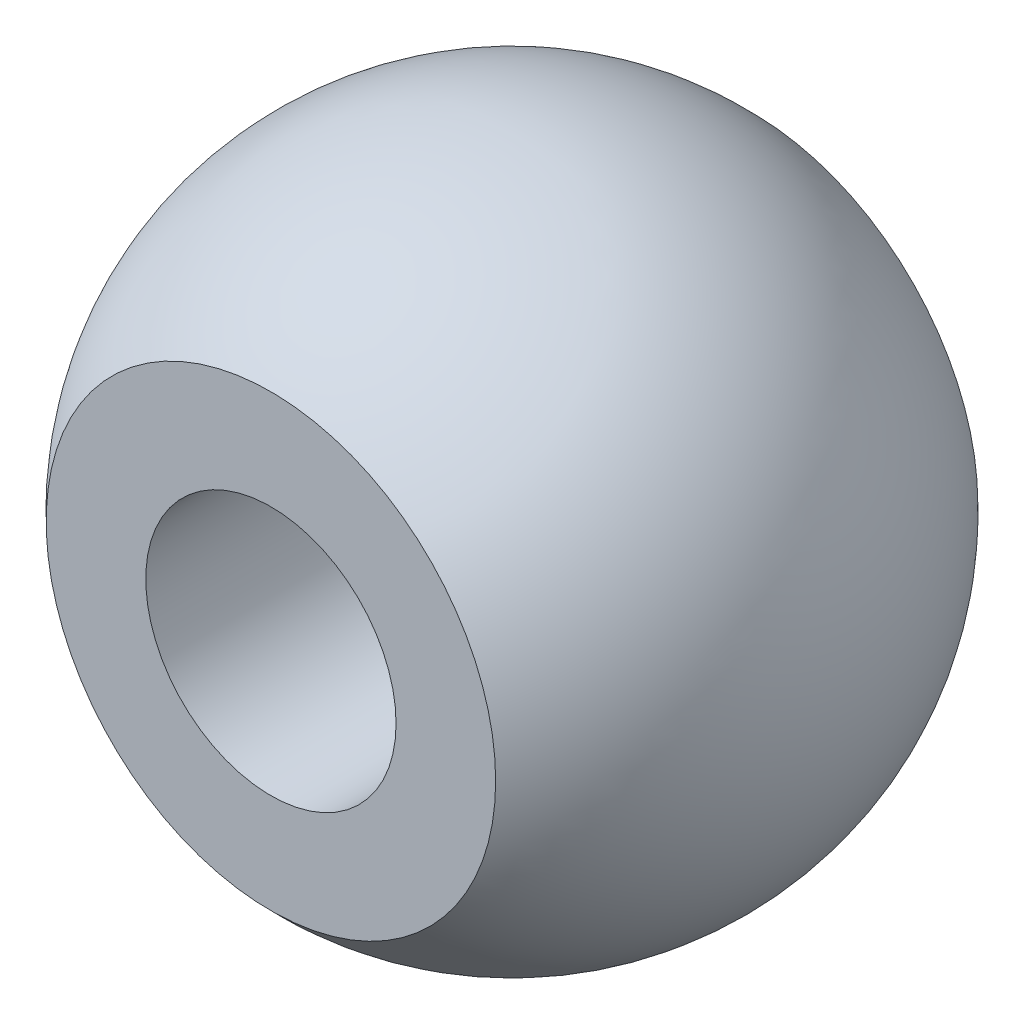
ISO-10303-21;
HEADER;
FILE_DESCRIPTION(('STEP AP214'),'2;1');
FILE_NAME('part.step','',(''),(''),'','','');
FILE_SCHEMA(('AUTOMOTIVE_DESIGN { 1 0 10303 214 1 1 1 1 }'));
ENDSEC;
DATA;
#1=APPLICATION_CONTEXT('core data for automotive mechanical design processes');
#2=APPLICATION_PROTOCOL_DEFINITION('international standard','automotive_design',2000,#1);
#3=PRODUCT_CONTEXT('',#1,'mechanical');
#4=PRODUCT('Part','Part','',(#3));
#5=PRODUCT_RELATED_PRODUCT_CATEGORY('part','',(#4));
#6=PRODUCT_DEFINITION_FORMATION('','',#4);
#7=PRODUCT_DEFINITION_CONTEXT('part definition',#1,'design');
#8=PRODUCT_DEFINITION('design','',#6,#7);
#9=PRODUCT_DEFINITION_SHAPE('','',#8);
#10=(LENGTH_UNIT() NAMED_UNIT(*) SI_UNIT(.MILLI.,.METRE.));
#11=(NAMED_UNIT(*) PLANE_ANGLE_UNIT() SI_UNIT($,.RADIAN.));
#12=(NAMED_UNIT(*) SI_UNIT($,.STERADIAN.) SOLID_ANGLE_UNIT());
#13=UNCERTAINTY_MEASURE_WITH_UNIT(LENGTH_MEASURE(1.E-05),#10,'distance_accuracy_value','');
#14=(GEOMETRIC_REPRESENTATION_CONTEXT(3) GLOBAL_UNCERTAINTY_ASSIGNED_CONTEXT((#13)) GLOBAL_UNIT_ASSIGNED_CONTEXT((#10,
#11,#12)) REPRESENTATION_CONTEXT('',''));
#15=CARTESIAN_POINT('',(0.,0.,0.));
#16=DIRECTION('',(0.,0.,1.));
#17=DIRECTION('',(1.,0.,0.));
#18=AXIS2_PLACEMENT_3D('',#15,#16,#17);
#19=CARTESIAN_POINT('',(0.,0.,0.));
#20=DIRECTION('',(0.,0.,1.));
#21=DIRECTION('',(-1.,0.,0.));
#22=AXIS2_PLACEMENT_3D('',#19,#20,#21);
#23=SPHERICAL_SURFACE('',#22,3.95);
#24=CARTESIAN_POINT('',(0.,0.,-2.8890438235165));
#25=DIRECTION('',(0.,0.,1.));
#26=DIRECTION('',(1.,0.,0.));
#27=AXIS2_PLACEMENT_3D('',#24,#25,#26);
#28=CIRCLE('',#27,2.69368256960637);
#29=CARTESIAN_POINT('',(2.69368256960637,0.,-2.8890438235165));
#30=VERTEX_POINT('',#29);
#31=EDGE_CURVE('E45',#30,#30,#28,.F.);
#32=ORIENTED_EDGE('',*,*,#31,.F.);
#33=EDGE_LOOP('',(#32));
#34=FACE_BOUND('',#33,.T.);
#35=CARTESIAN_POINT('',(0.,0.,2.8890438235165));
#36=DIRECTION('',(0.,0.,1.));
#37=DIRECTION('',(1.,0.,0.));
#38=AXIS2_PLACEMENT_3D('',#35,#36,#37);
#39=CIRCLE('',#38,2.69368256960637);
#40=CARTESIAN_POINT('',(2.69368256960637,0.,2.8890438235165));
#41=VERTEX_POINT('',#40);
#42=EDGE_CURVE('E10',#41,#41,#39,.F.);
#43=ORIENTED_EDGE('',*,*,#42,.T.);
#44=EDGE_LOOP('',(#43));
#45=FACE_BOUND('',#44,.T.);
#46=ADVANCED_FACE('F39',(#34,#45),#23,.T.);
#47=CARTESIAN_POINT('',(0.,-3.95,-2.8890438235165));
#48=DIRECTION('',(0.,0.,1.));
#49=DIRECTION('',(1.,0.,0.));
#50=AXIS2_PLACEMENT_3D('',#47,#48,#49);
#51=PLANE('',#50);
#52=CARTESIAN_POINT('',(0.,0.,-2.8890438235165));
#53=DIRECTION('',(0.,0.,1.));
#54=DIRECTION('',(1.,0.,0.));
#55=AXIS2_PLACEMENT_3D('',#52,#53,#54);
#56=CIRCLE('',#55,1.5);
#57=CARTESIAN_POINT('',(1.5,0.,-2.8890438235165));
#58=VERTEX_POINT('',#57);
#59=EDGE_CURVE('E49',#58,#58,#56,.T.);
#60=ORIENTED_EDGE('',*,*,#59,.T.);
#61=EDGE_LOOP('',(#60));
#62=FACE_BOUND('',#61,.T.);
#63=ORIENTED_EDGE('',*,*,#31,.T.);
#64=EDGE_LOOP('',(#63));
#65=FACE_BOUND('',#64,.T.);
#66=ADVANCED_FACE('F64',(#62,#65),#51,.F.);
#67=CARTESIAN_POINT('',(0.,-3.95,2.8890438235165));
#68=DIRECTION('',(0.,0.,1.));
#69=DIRECTION('',(1.,0.,0.));
#70=AXIS2_PLACEMENT_3D('',#67,#68,#69);
#71=PLANE('',#70);
#72=CARTESIAN_POINT('',(0.,0.,2.8890438235165));
#73=DIRECTION('',(0.,0.,1.));
#74=DIRECTION('',(1.,0.,0.));
#75=AXIS2_PLACEMENT_3D('',#72,#73,#74);
#76=CIRCLE('',#75,1.5);
#77=CARTESIAN_POINT('',(1.5,0.,2.8890438235165));
#78=VERTEX_POINT('',#77);
#79=EDGE_CURVE('E53',#78,#78,#76,.T.);
#80=ORIENTED_EDGE('',*,*,#79,.F.);
#81=EDGE_LOOP('',(#80));
#82=FACE_BOUND('',#81,.T.);
#83=ORIENTED_EDGE('',*,*,#42,.F.);
#84=EDGE_LOOP('',(#83));
#85=FACE_BOUND('',#84,.T.);
#86=ADVANCED_FACE('F61',(#82,#85),#71,.T.);
#87=CARTESIAN_POINT('',(0.,0.,-2.8890438235165));
#88=DIRECTION('',(0.,0.,1.));
#89=DIRECTION('',(1.,0.,0.));
#90=AXIS2_PLACEMENT_3D('',#87,#88,#89);
#91=CYLINDRICAL_SURFACE('',#90,1.5);
#92=ORIENTED_EDGE('',*,*,#59,.F.);
#93=EDGE_LOOP('',(#92));
#94=FACE_BOUND('',#93,.T.);
#95=ORIENTED_EDGE('',*,*,#79,.T.);
#96=EDGE_LOOP('',(#95));
#97=FACE_BOUND('',#96,.T.);
#98=ADVANCED_FACE('F59',(#94,#97),#91,.F.);
#99=CLOSED_SHELL('',(#46,#66,#86,#98));
#100=MANIFOLD_SOLID_BREP('B2',#99);
#101=ADVANCED_BREP_SHAPE_REPRESENTATION('',(#18,#100),#14);
#102=SHAPE_DEFINITION_REPRESENTATION(#9,#101);
ENDSEC;
END-ISO-10303-21;
